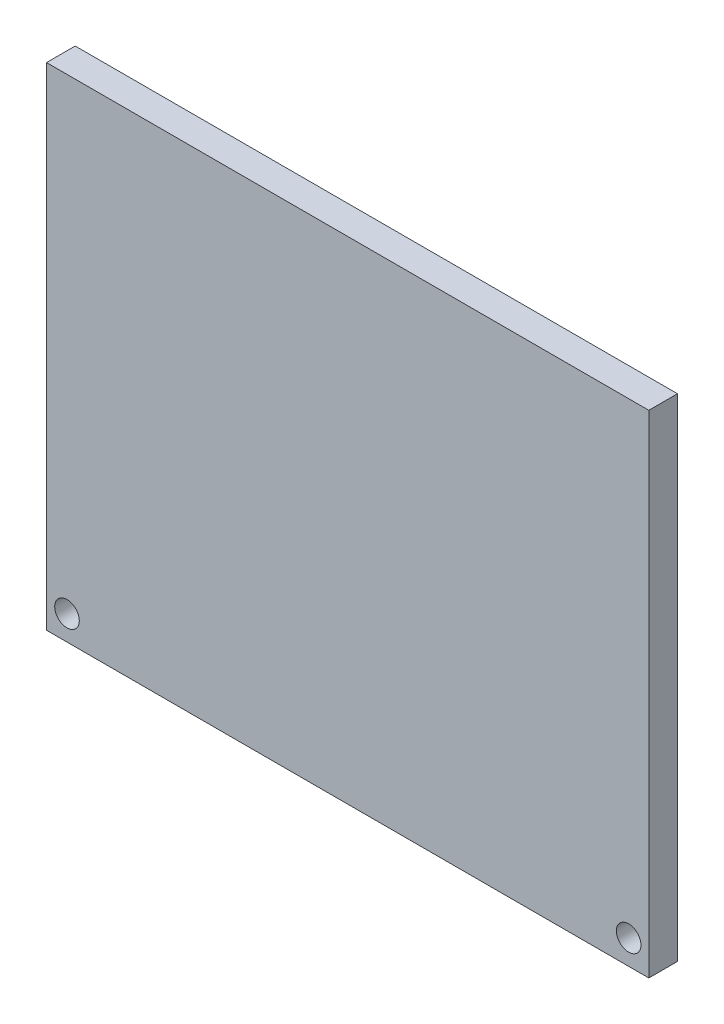
ISO-10303-21;
HEADER;
FILE_DESCRIPTION(('STEP AP214'),'2;1');
FILE_NAME('part.step','',(''),(''),'','','');
FILE_SCHEMA(('AUTOMOTIVE_DESIGN { 1 0 10303 214 1 1 1 1 }'));
ENDSEC;
DATA;
#1=APPLICATION_CONTEXT('core data for automotive mechanical design processes');
#2=APPLICATION_PROTOCOL_DEFINITION('international standard','automotive_design',2000,#1);
#3=PRODUCT_CONTEXT('',#1,'mechanical');
#4=PRODUCT('Part','Part','',(#3));
#5=PRODUCT_RELATED_PRODUCT_CATEGORY('part','',(#4));
#6=PRODUCT_DEFINITION_FORMATION('','',#4);
#7=PRODUCT_DEFINITION_CONTEXT('part definition',#1,'design');
#8=PRODUCT_DEFINITION('design','',#6,#7);
#9=PRODUCT_DEFINITION_SHAPE('','',#8);
#10=(LENGTH_UNIT() NAMED_UNIT(*) SI_UNIT(.MILLI.,.METRE.));
#11=(NAMED_UNIT(*) PLANE_ANGLE_UNIT() SI_UNIT($,.RADIAN.));
#12=(NAMED_UNIT(*) SI_UNIT($,.STERADIAN.) SOLID_ANGLE_UNIT());
#13=UNCERTAINTY_MEASURE_WITH_UNIT(LENGTH_MEASURE(1.E-05),#10,'distance_accuracy_value','');
#14=(GEOMETRIC_REPRESENTATION_CONTEXT(3) GLOBAL_UNCERTAINTY_ASSIGNED_CONTEXT((#13)) GLOBAL_UNIT_ASSIGNED_CONTEXT((#10,
#11,#12)) REPRESENTATION_CONTEXT('',''));
#15=CARTESIAN_POINT('',(0.,0.,0.));
#16=DIRECTION('',(0.,0.,1.));
#17=DIRECTION('',(1.,0.,0.));
#18=AXIS2_PLACEMENT_3D('',#15,#16,#17);
#19=CARTESIAN_POINT('',(73.5,-60.,7.));
#20=DIRECTION('',(0.,0.,1.));
#21=DIRECTION('',(1.,0.,0.));
#22=AXIS2_PLACEMENT_3D('',#19,#20,#21);
#23=PLANE('',#22);
#24=CARTESIAN_POINT('',(-68.5,-54.,7.));
#25=DIRECTION('',(0.,0.,1.));
#26=DIRECTION('',(1.,0.,0.));
#27=AXIS2_PLACEMENT_3D('',#24,#25,#26);
#28=CIRCLE('',#27,3.00000000000001);
#29=CARTESIAN_POINT('',(-65.5,-54.,7.));
#30=VERTEX_POINT('',#29);
#31=EDGE_CURVE('E98',#30,#30,#28,.T.);
#32=ORIENTED_EDGE('',*,*,#31,.F.);
#33=EDGE_LOOP('',(#32));
#34=FACE_BOUND('',#33,.T.);
#35=DIRECTION('',(0.,1.,0.));
#36=VECTOR('',#35,1.);
#37=CARTESIAN_POINT('',(73.5,60.,7.));
#38=LINE('',#37,#36);
#39=CARTESIAN_POINT('',(73.5,-60.,7.));
#40=VERTEX_POINT('',#39);
#41=CARTESIAN_POINT('',(73.5,60.,7.));
#42=VERTEX_POINT('',#41);
#43=EDGE_CURVE('E83',#40,#42,#38,.T.);
#44=ORIENTED_EDGE('',*,*,#43,.T.);
#45=DIRECTION('',(-1.,0.,0.));
#46=VECTOR('',#45,1.);
#47=CARTESIAN_POINT('',(-73.5000000000001,60.,7.));
#48=LINE('',#47,#46);
#49=CARTESIAN_POINT('',(-73.5000000000001,60.,7.));
#50=VERTEX_POINT('',#49);
#51=EDGE_CURVE('E78',#42,#50,#48,.T.);
#52=ORIENTED_EDGE('',*,*,#51,.T.);
#53=DIRECTION('',(0.,-1.,0.));
#54=VECTOR('',#53,1.);
#55=CARTESIAN_POINT('',(-73.5000000000001,60.,7.));
#56=LINE('',#55,#54);
#57=CARTESIAN_POINT('',(-73.5,-60.,7.));
#58=VERTEX_POINT('',#57);
#59=EDGE_CURVE('E81',#50,#58,#56,.T.);
#60=ORIENTED_EDGE('',*,*,#59,.T.);
#61=DIRECTION('',(1.,0.,0.));
#62=VECTOR('',#61,1.);
#63=CARTESIAN_POINT('',(-73.5,-60.,7.));
#64=LINE('',#63,#62);
#65=EDGE_CURVE('E48',#58,#40,#64,.T.);
#66=ORIENTED_EDGE('',*,*,#65,.T.);
#67=EDGE_LOOP('',(#44,#52,#60,#66));
#68=FACE_BOUND('',#67,.T.);
#69=CARTESIAN_POINT('',(68.58,-54.,7.));
#70=DIRECTION('',(0.,0.,1.));
#71=DIRECTION('',(1.,0.,0.));
#72=AXIS2_PLACEMENT_3D('',#69,#70,#71);
#73=CIRCLE('',#72,3.00000000000001);
#74=CARTESIAN_POINT('',(71.58,-54.,7.));
#75=VERTEX_POINT('',#74);
#76=EDGE_CURVE('E113',#75,#75,#73,.T.);
#77=ORIENTED_EDGE('',*,*,#76,.F.);
#78=EDGE_LOOP('',(#77));
#79=FACE_BOUND('',#78,.T.);
#80=ADVANCED_FACE('F31',(#34,#68,#79),#23,.T.);
#81=CARTESIAN_POINT('',(73.5,-60.,0.));
#82=DIRECTION('',(0.,0.,1.));
#83=DIRECTION('',(1.,0.,0.));
#84=AXIS2_PLACEMENT_3D('',#81,#82,#83);
#85=PLANE('',#84);
#86=CARTESIAN_POINT('',(-68.5,-54.,0.));
#87=DIRECTION('',(0.,0.,1.));
#88=DIRECTION('',(1.,0.,0.));
#89=AXIS2_PLACEMENT_3D('',#86,#87,#88);
#90=CIRCLE('',#89,3.00000000000001);
#91=CARTESIAN_POINT('',(-65.5,-54.,0.));
#92=VERTEX_POINT('',#91);
#93=EDGE_CURVE('E110',#92,#92,#90,.T.);
#94=ORIENTED_EDGE('',*,*,#93,.T.);
#95=EDGE_LOOP('',(#94));
#96=FACE_BOUND('',#95,.T.);
#97=DIRECTION('',(0.,1.,0.));
#98=VECTOR('',#97,1.);
#99=CARTESIAN_POINT('',(73.5,60.,0.));
#100=LINE('',#99,#98);
#101=CARTESIAN_POINT('',(73.5,-60.,0.));
#102=VERTEX_POINT('',#101);
#103=CARTESIAN_POINT('',(73.5,60.,0.));
#104=VERTEX_POINT('',#103);
#105=EDGE_CURVE('E95',#102,#104,#100,.T.);
#106=ORIENTED_EDGE('',*,*,#105,.F.);
#107=DIRECTION('',(1.,0.,0.));
#108=VECTOR('',#107,1.);
#109=CARTESIAN_POINT('',(-73.5,-60.,0.));
#110=LINE('',#109,#108);
#111=CARTESIAN_POINT('',(-73.5,-60.,0.));
#112=VERTEX_POINT('',#111);
#113=EDGE_CURVE('E71',#112,#102,#110,.T.);
#114=ORIENTED_EDGE('',*,*,#113,.F.);
#115=DIRECTION('',(0.,-1.,0.));
#116=VECTOR('',#115,1.);
#117=CARTESIAN_POINT('',(-73.5000000000001,60.,0.));
#118=LINE('',#117,#116);
#119=CARTESIAN_POINT('',(-73.5000000000001,60.,0.));
#120=VERTEX_POINT('',#119);
#121=EDGE_CURVE('E65',#120,#112,#118,.T.);
#122=ORIENTED_EDGE('',*,*,#121,.F.);
#123=DIRECTION('',(-1.,0.,0.));
#124=VECTOR('',#123,1.);
#125=CARTESIAN_POINT('',(-73.5000000000001,60.,0.));
#126=LINE('',#125,#124);
#127=EDGE_CURVE('E87',#104,#120,#126,.T.);
#128=ORIENTED_EDGE('',*,*,#127,.F.);
#129=EDGE_LOOP('',(#106,#114,#122,#128));
#130=FACE_BOUND('',#129,.T.);
#131=CARTESIAN_POINT('',(68.58,-54.,0.));
#132=DIRECTION('',(0.,0.,1.));
#133=DIRECTION('',(1.,0.,0.));
#134=AXIS2_PLACEMENT_3D('',#131,#132,#133);
#135=CIRCLE('',#134,3.00000000000001);
#136=CARTESIAN_POINT('',(71.58,-54.,0.));
#137=VERTEX_POINT('',#136);
#138=EDGE_CURVE('E116',#137,#137,#135,.T.);
#139=ORIENTED_EDGE('',*,*,#138,.T.);
#140=EDGE_LOOP('',(#139));
#141=FACE_BOUND('',#140,.T.);
#142=ADVANCED_FACE('F106',(#96,#130,#141),#85,.F.);
#143=CARTESIAN_POINT('',(73.5,60.,7.));
#144=DIRECTION('',(-1.,0.,0.));
#145=DIRECTION('',(0.,-1.,0.));
#146=AXIS2_PLACEMENT_3D('',#143,#144,#145);
#147=PLANE('',#146);
#148=ORIENTED_EDGE('',*,*,#105,.T.);
#149=DIRECTION('',(0.,0.,-1.));
#150=VECTOR('',#149,1.);
#151=CARTESIAN_POINT('',(73.5,60.,7.));
#152=LINE('',#151,#150);
#153=EDGE_CURVE('E11',#42,#104,#152,.T.);
#154=ORIENTED_EDGE('',*,*,#153,.F.);
#155=ORIENTED_EDGE('',*,*,#43,.F.);
#156=DIRECTION('',(0.,0.,-1.));
#157=VECTOR('',#156,1.);
#158=CARTESIAN_POINT('',(73.5,-60.,7.));
#159=LINE('',#158,#157);
#160=EDGE_CURVE('E91',#40,#102,#159,.T.);
#161=ORIENTED_EDGE('',*,*,#160,.T.);
#162=EDGE_LOOP('',(#148,#154,#155,#161));
#163=FACE_BOUND('',#162,.T.);
#164=ADVANCED_FACE('F33',(#163),#147,.F.);
#165=CARTESIAN_POINT('',(-73.5000000000001,60.,7.));
#166=DIRECTION('',(0.,-1.,0.));
#167=DIRECTION('',(0.,0.,-1.));
#168=AXIS2_PLACEMENT_3D('',#165,#166,#167);
#169=PLANE('',#168);
#170=ORIENTED_EDGE('',*,*,#127,.T.);
#171=DIRECTION('',(0.,0.,-1.));
#172=VECTOR('',#171,1.);
#173=CARTESIAN_POINT('',(-73.5000000000001,60.,7.));
#174=LINE('',#173,#172);
#175=EDGE_CURVE('E40',#50,#120,#174,.T.);
#176=ORIENTED_EDGE('',*,*,#175,.F.);
#177=ORIENTED_EDGE('',*,*,#51,.F.);
#178=ORIENTED_EDGE('',*,*,#153,.T.);
#179=EDGE_LOOP('',(#170,#176,#177,#178));
#180=FACE_BOUND('',#179,.T.);
#181=ADVANCED_FACE('F86',(#180),#169,.F.);
#182=CARTESIAN_POINT('',(-73.5000000000001,60.,7.));
#183=DIRECTION('',(1.,0.,0.));
#184=DIRECTION('',(0.,1.,0.));
#185=AXIS2_PLACEMENT_3D('',#182,#183,#184);
#186=PLANE('',#185);
#187=ORIENTED_EDGE('',*,*,#121,.T.);
#188=DIRECTION('',(0.,0.,-1.));
#189=VECTOR('',#188,1.);
#190=CARTESIAN_POINT('',(-73.5,-60.,7.));
#191=LINE('',#190,#189);
#192=EDGE_CURVE('E88',#58,#112,#191,.T.);
#193=ORIENTED_EDGE('',*,*,#192,.F.);
#194=ORIENTED_EDGE('',*,*,#59,.F.);
#195=ORIENTED_EDGE('',*,*,#175,.T.);
#196=EDGE_LOOP('',(#187,#193,#194,#195));
#197=FACE_BOUND('',#196,.T.);
#198=ADVANCED_FACE('F89',(#197),#186,.F.);
#199=CARTESIAN_POINT('',(-73.5,-60.,7.));
#200=DIRECTION('',(0.,1.,0.));
#201=DIRECTION('',(0.,0.,1.));
#202=AXIS2_PLACEMENT_3D('',#199,#200,#201);
#203=PLANE('',#202);
#204=ORIENTED_EDGE('',*,*,#113,.T.);
#205=ORIENTED_EDGE('',*,*,#160,.F.);
#206=ORIENTED_EDGE('',*,*,#65,.F.);
#207=ORIENTED_EDGE('',*,*,#192,.T.);
#208=EDGE_LOOP('',(#204,#205,#206,#207));
#209=FACE_BOUND('',#208,.T.);
#210=ADVANCED_FACE('F103',(#209),#203,.F.);
#211=CARTESIAN_POINT('',(-68.5,-54.,7.));
#212=DIRECTION('',(0.,0.,-1.));
#213=DIRECTION('',(-1.,0.,0.));
#214=AXIS2_PLACEMENT_3D('',#211,#212,#213);
#215=CYLINDRICAL_SURFACE('',#214,3.00000000000001);
#216=ORIENTED_EDGE('',*,*,#31,.T.);
#217=EDGE_LOOP('',(#216));
#218=FACE_BOUND('',#217,.T.);
#219=ORIENTED_EDGE('',*,*,#93,.F.);
#220=EDGE_LOOP('',(#219));
#221=FACE_BOUND('',#220,.T.);
#222=ADVANCED_FACE('F134',(#218,#221),#215,.F.);
#223=CARTESIAN_POINT('',(68.58,-54.,7.));
#224=DIRECTION('',(0.,0.,-1.));
#225=DIRECTION('',(-1.,0.,0.));
#226=AXIS2_PLACEMENT_3D('',#223,#224,#225);
#227=CYLINDRICAL_SURFACE('',#226,3.00000000000001);
#228=ORIENTED_EDGE('',*,*,#76,.T.);
#229=EDGE_LOOP('',(#228));
#230=FACE_BOUND('',#229,.T.);
#231=ORIENTED_EDGE('',*,*,#138,.F.);
#232=EDGE_LOOP('',(#231));
#233=FACE_BOUND('',#232,.T.);
#234=ADVANCED_FACE('F122',(#230,#233),#227,.F.);
#235=CLOSED_SHELL('',(#80,#142,#164,#181,#198,#210,#222,#234));
#236=MANIFOLD_SOLID_BREP('B2',#235);
#237=ADVANCED_BREP_SHAPE_REPRESENTATION('',(#18,#236),#14);
#238=SHAPE_DEFINITION_REPRESENTATION(#9,#237);
ENDSEC;
END-ISO-10303-21;
